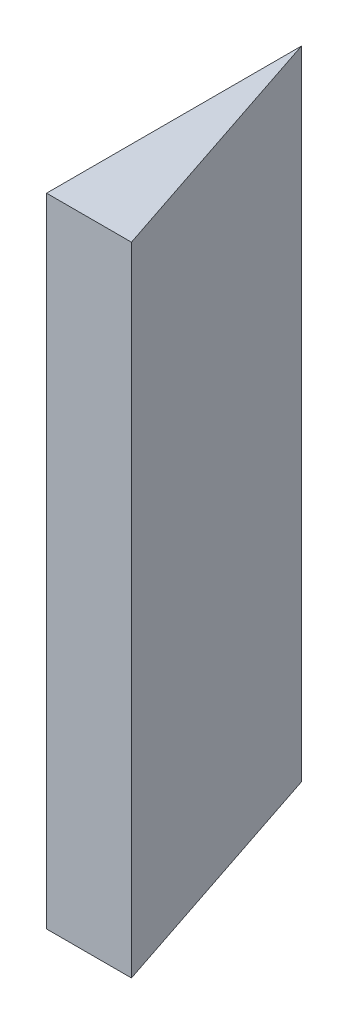
ISO-10303-21;
HEADER;
FILE_DESCRIPTION(('STEP AP214'),'2;1');
FILE_NAME('part.step','',(''),(''),'','','');
FILE_SCHEMA(('AUTOMOTIVE_DESIGN { 1 0 10303 214 1 1 1 1 }'));
ENDSEC;
DATA;
#1=APPLICATION_CONTEXT('core data for automotive mechanical design processes');
#2=APPLICATION_PROTOCOL_DEFINITION('international standard','automotive_design',2000,#1);
#3=PRODUCT_CONTEXT('',#1,'mechanical');
#4=PRODUCT('Part','Part','',(#3));
#5=PRODUCT_RELATED_PRODUCT_CATEGORY('part','',(#4));
#6=PRODUCT_DEFINITION_FORMATION('','',#4);
#7=PRODUCT_DEFINITION_CONTEXT('part definition',#1,'design');
#8=PRODUCT_DEFINITION('design','',#6,#7);
#9=PRODUCT_DEFINITION_SHAPE('','',#8);
#10=(LENGTH_UNIT() NAMED_UNIT(*) SI_UNIT(.MILLI.,.METRE.));
#11=(NAMED_UNIT(*) PLANE_ANGLE_UNIT() SI_UNIT($,.RADIAN.));
#12=(NAMED_UNIT(*) SI_UNIT($,.STERADIAN.) SOLID_ANGLE_UNIT());
#13=UNCERTAINTY_MEASURE_WITH_UNIT(LENGTH_MEASURE(1.E-05),#10,'distance_accuracy_value','');
#14=(GEOMETRIC_REPRESENTATION_CONTEXT(3) GLOBAL_UNCERTAINTY_ASSIGNED_CONTEXT((#13)) GLOBAL_UNIT_ASSIGNED_CONTEXT((#10,
#11,#12)) REPRESENTATION_CONTEXT('',''));
#15=CARTESIAN_POINT('',(0.,0.,0.));
#16=DIRECTION('',(0.,0.,1.));
#17=DIRECTION('',(1.,0.,0.));
#18=AXIS2_PLACEMENT_3D('',#15,#16,#17);
#19=CARTESIAN_POINT('',(-3.91999969402031,1.75000050355419,-3.67112136800623));
#20=DIRECTION('',(-1.74845553146952E-07,-1.,-8.74227765734759E-08));
#21=DIRECTION('',(1.,-1.74845553146952E-07,0.));
#22=AXIS2_PLACEMENT_3D('',#19,#20,#21);
#23=PLANE('',#22);
#24=DIRECTION('',(0.,8.74227767955201E-08,-0.999999999999996));
#25=VECTOR('',#24,1.);
#26=CARTESIAN_POINT('',(-3.89999969402032,1.75000046333972,-3.25112136800623));
#27=LINE('',#26,#25);
#28=CARTESIAN_POINT('',(-3.89999969402032,1.75000046333872,-3.25112136800623));
#29=VERTEX_POINT('',#28);
#30=CARTESIAN_POINT('',(-3.89999969402031,1.75000049830783,-3.65112136800623));
#31=VERTEX_POINT('',#30);
#32=EDGE_CURVE('E11',#29,#31,#27,.T.);
#33=ORIENTED_EDGE('',*,*,#32,.F.);
#34=DIRECTION('',(-0.999999999999985,1.74845553322981E-07,0.));
#35=VECTOR('',#34,1.);
#36=CARTESIAN_POINT('',(-3.76677751937632,1.75000044004641,-3.25112136800623));
#37=LINE('',#36,#35);
#38=CARTESIAN_POINT('',(-3.76677751937632,1.75000044004541,-3.25112136800623));
#39=VERTEX_POINT('',#38);
#40=EDGE_CURVE('E63',#39,#29,#37,.T.);
#41=ORIENTED_EDGE('',*,*,#40,.F.);
#42=DIRECTION('',(0.31599046396719,-1.38192967524256E-07,0.948762365759615));
#43=VECTOR('',#42,1.);
#44=CARTESIAN_POINT('',(-3.89999969402031,1.75000049830883,-3.65112136800624));
#45=LINE('',#44,#43);
#46=EDGE_CURVE('E70',#31,#39,#45,.T.);
#47=ORIENTED_EDGE('',*,*,#46,.F.);
#48=EDGE_LOOP('',(#33,#41,#47));
#49=FACE_BOUND('',#48,.T.);
#50=ADVANCED_FACE('F17',(#49),#23,.F.);
#51=CARTESIAN_POINT('',(-3.91999986886587,0.750000503554193,-3.67112145542901));
#52=DIRECTION('',(-1.74845553146952E-07,-1.,-8.74227765734759E-08));
#53=DIRECTION('',(1.,-1.74845553146952E-07,0.));
#54=AXIS2_PLACEMENT_3D('',#51,#52,#53);
#55=PLANE('',#54);
#56=DIRECTION('',(0.315990463967191,-1.38192968050925E-07,0.948762365759614));
#57=VECTOR('',#56,1.);
#58=CARTESIAN_POINT('',(-3.89999986886587,0.750000498308827,-3.65112145542901));
#59=LINE('',#58,#57);
#60=CARTESIAN_POINT('',(-3.89999986886587,0.750000498309826,-3.65112145542901));
#61=VERTEX_POINT('',#60);
#62=CARTESIAN_POINT('',(-3.76677769422187,0.750000440047411,-3.25112145542901));
#63=VERTEX_POINT('',#62);
#64=EDGE_CURVE('E24',#61,#63,#59,.T.);
#65=ORIENTED_EDGE('',*,*,#64,.T.);
#66=DIRECTION('',(-0.999999999999985,1.74845553322982E-07,0.));
#67=VECTOR('',#66,1.);
#68=CARTESIAN_POINT('',(-3.76677769422187,0.750000440046411,-3.25112145542901));
#69=LINE('',#68,#67);
#70=CARTESIAN_POINT('',(-3.89999986886587,0.750000463340716,-3.25112145542901));
#71=VERTEX_POINT('',#70);
#72=EDGE_CURVE('E49',#63,#71,#69,.T.);
#73=ORIENTED_EDGE('',*,*,#72,.T.);
#74=DIRECTION('',(0.,8.74227767955201E-08,-0.999999999999996));
#75=VECTOR('',#74,1.);
#76=CARTESIAN_POINT('',(-3.89999986886587,0.750000463339716,-3.25112145542901));
#77=LINE('',#76,#75);
#78=EDGE_CURVE('E46',#71,#61,#77,.T.);
#79=ORIENTED_EDGE('',*,*,#78,.T.);
#80=EDGE_LOOP('',(#65,#73,#79));
#81=FACE_BOUND('',#80,.T.);
#82=ADVANCED_FACE('F47',(#81),#55,.T.);
#83=CARTESIAN_POINT('',(-3.89999969402031,1.75000049830883,-3.65112136800623));
#84=DIRECTION('',(0.948762365759624,-1.38262116889164E-07,-0.315990463967207));
#85=DIRECTION('',(0.315990463967192,-1.38192967784634E-07,0.948762365759619));
#86=AXIS2_PLACEMENT_3D('',#83,#84,#85);
#87=PLANE('',#86);
#88=ORIENTED_EDGE('',*,*,#46,.T.);
#89=DIRECTION('',(-1.74845553146948E-07,-0.999999999999981,-8.74227765734742E-08));
#90=VECTOR('',#89,1.);
#91=CARTESIAN_POINT('',(-3.76677751937632,1.75000044004641,-3.25112136800624));
#92=LINE('',#91,#90);
#93=EDGE_CURVE('E54',#39,#63,#92,.T.);
#94=ORIENTED_EDGE('',*,*,#93,.T.);
#95=ORIENTED_EDGE('',*,*,#64,.F.);
#96=DIRECTION('',(-1.74845553146948E-07,-0.999999999999981,-8.74227765734742E-08));
#97=VECTOR('',#96,1.);
#98=CARTESIAN_POINT('',(-3.89999969402031,1.75000049830883,-3.65112136800624));
#99=LINE('',#98,#97);
#100=EDGE_CURVE('E61',#31,#61,#99,.T.);
#101=ORIENTED_EDGE('',*,*,#100,.F.);
#102=EDGE_LOOP('',(#88,#94,#95,#101));
#103=FACE_BOUND('',#102,.T.);
#104=ADVANCED_FACE('F60',(#103),#87,.T.);
#105=CARTESIAN_POINT('',(-3.76677751937632,1.75000044004641,-3.25112136800623));
#106=DIRECTION('',(0.,-8.74227765734759E-08,1.));
#107=DIRECTION('',(-1.,1.74845553146952E-07,0.));
#108=AXIS2_PLACEMENT_3D('',#105,#106,#107);
#109=PLANE('',#108);
#110=ORIENTED_EDGE('',*,*,#40,.T.);
#111=DIRECTION('',(-1.74845553146948E-07,-0.999999999999981,-8.74227765734742E-08));
#112=VECTOR('',#111,1.);
#113=CARTESIAN_POINT('',(-3.89999969402032,1.75000046333972,-3.25112136800623));
#114=LINE('',#113,#112);
#115=EDGE_CURVE('E55',#29,#71,#114,.T.);
#116=ORIENTED_EDGE('',*,*,#115,.T.);
#117=ORIENTED_EDGE('',*,*,#72,.F.);
#118=ORIENTED_EDGE('',*,*,#93,.F.);
#119=EDGE_LOOP('',(#110,#116,#117,#118));
#120=FACE_BOUND('',#119,.T.);
#121=ADVANCED_FACE('F73',(#120),#109,.T.);
#122=CARTESIAN_POINT('',(-3.89999969402032,1.75000046333972,-3.25112136800623));
#123=DIRECTION('',(-1.,1.74845553146952E-07,0.));
#124=DIRECTION('',(0.,8.74227765734759E-08,-1.));
#125=AXIS2_PLACEMENT_3D('',#122,#123,#124);
#126=PLANE('',#125);
#127=ORIENTED_EDGE('',*,*,#32,.T.);
#128=ORIENTED_EDGE('',*,*,#100,.T.);
#129=ORIENTED_EDGE('',*,*,#78,.F.);
#130=ORIENTED_EDGE('',*,*,#115,.F.);
#131=EDGE_LOOP('',(#127,#128,#129,#130));
#132=FACE_BOUND('',#131,.T.);
#133=ADVANCED_FACE('F64',(#132),#126,.T.);
#134=CLOSED_SHELL('',(#50,#82,#104,#121,#133));
#135=MANIFOLD_SOLID_BREP('B1',#134);
#136=ADVANCED_BREP_SHAPE_REPRESENTATION('',(#18,#135),#14);
#137=SHAPE_DEFINITION_REPRESENTATION(#9,#136);
ENDSEC;
END-ISO-10303-21;
